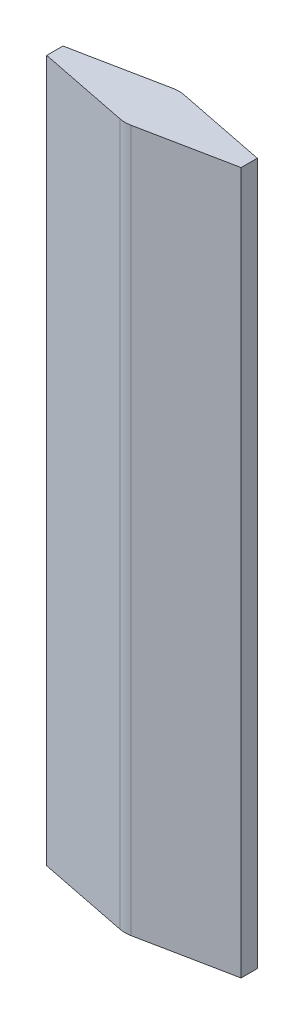
ISO-10303-21;
HEADER;
FILE_DESCRIPTION(('STEP AP214'),'2;1');
FILE_NAME('part.step','',(''),(''),'','','');
FILE_SCHEMA(('AUTOMOTIVE_DESIGN { 1 0 10303 214 1 1 1 1 }'));
ENDSEC;
DATA;
#1=APPLICATION_CONTEXT('core data for automotive mechanical design processes');
#2=APPLICATION_PROTOCOL_DEFINITION('international standard','automotive_design',2000,#1);
#3=PRODUCT_CONTEXT('',#1,'mechanical');
#4=PRODUCT('Part','Part','',(#3));
#5=PRODUCT_RELATED_PRODUCT_CATEGORY('part','',(#4));
#6=PRODUCT_DEFINITION_FORMATION('','',#4);
#7=PRODUCT_DEFINITION_CONTEXT('part definition',#1,'design');
#8=PRODUCT_DEFINITION('design','',#6,#7);
#9=PRODUCT_DEFINITION_SHAPE('','',#8);
#10=(LENGTH_UNIT() NAMED_UNIT(*) SI_UNIT(.MILLI.,.METRE.));
#11=(NAMED_UNIT(*) PLANE_ANGLE_UNIT() SI_UNIT($,.RADIAN.));
#12=(NAMED_UNIT(*) SI_UNIT($,.STERADIAN.) SOLID_ANGLE_UNIT());
#13=UNCERTAINTY_MEASURE_WITH_UNIT(LENGTH_MEASURE(1.E-05),#10,'distance_accuracy_value','');
#14=(GEOMETRIC_REPRESENTATION_CONTEXT(3) GLOBAL_UNCERTAINTY_ASSIGNED_CONTEXT((#13)) GLOBAL_UNIT_ASSIGNED_CONTEXT((#10,
#11,#12)) REPRESENTATION_CONTEXT('',''));
#15=CARTESIAN_POINT('',(0.,0.,0.));
#16=DIRECTION('',(0.,0.,1.));
#17=DIRECTION('',(1.,0.,0.));
#18=AXIS2_PLACEMENT_3D('',#15,#16,#17);
#19=CARTESIAN_POINT('',(-180.,650.,15.0111579880046));
#20=DIRECTION('',(0.196,0.,-0.9806038955664));
#21=DIRECTION('',(-0.9806038955664,0.,-0.196));
#22=AXIS2_PLACEMENT_3D('',#19,#20,#21);
#23=PLANE('',#22);
#24=DIRECTION('',(0.9806038955664,0.,0.196));
#25=VECTOR('',#24,1.);
#26=CARTESIAN_POINT('',(-180.,-650.,15.0111579880046));
#27=LINE('',#26,#25);
#28=CARTESIAN_POINT('',(-180.,-650.,15.0111579880046));
#29=VERTEX_POINT('',#28);
#30=CARTESIAN_POINT('',(-9.79999999999995,-650.,49.03019477832));
#31=VERTEX_POINT('',#30);
#32=EDGE_CURVE('E144',#29,#31,#27,.T.);
#33=ORIENTED_EDGE('',*,*,#32,.T.);
#34=DIRECTION('',(0.,-1.,0.));
#35=VECTOR('',#34,1.);
#36=CARTESIAN_POINT('',(-9.79999999999995,650.,49.03019477832));
#37=LINE('',#36,#35);
#38=CARTESIAN_POINT('',(-9.79999999999995,650.,49.03019477832));
#39=VERTEX_POINT('',#38);
#40=EDGE_CURVE('E48',#39,#31,#37,.T.);
#41=ORIENTED_EDGE('',*,*,#40,.F.);
#42=DIRECTION('',(0.9806038955664,0.,0.196));
#43=VECTOR('',#42,1.);
#44=CARTESIAN_POINT('',(-180.,650.,15.0111579880046));
#45=LINE('',#44,#43);
#46=CARTESIAN_POINT('',(-180.,650.,15.0111579880046));
#47=VERTEX_POINT('',#46);
#48=EDGE_CURVE('E100',#47,#39,#45,.T.);
#49=ORIENTED_EDGE('',*,*,#48,.F.);
#50=DIRECTION('',(0.,-1.,0.));
#51=VECTOR('',#50,1.);
#52=CARTESIAN_POINT('',(-180.,650.,15.0111579880046));
#53=LINE('',#52,#51);
#54=EDGE_CURVE('E11',#47,#29,#53,.T.);
#55=ORIENTED_EDGE('',*,*,#54,.T.);
#56=EDGE_LOOP('',(#33,#41,#49,#55));
#57=FACE_BOUND('',#56,.T.);
#58=ADVANCED_FACE('F39',(#57),#23,.F.);
#59=CARTESIAN_POINT('',(0.,650.,0.));
#60=DIRECTION('',(0.,-1.,0.));
#61=DIRECTION('',(0.,0.,-1.));
#62=AXIS2_PLACEMENT_3D('',#59,#60,#61);
#63=CYLINDRICAL_SURFACE('',#62,50.);
#64=CARTESIAN_POINT('',(0.,-650.,0.));
#65=DIRECTION('',(0.,1.,0.));
#66=DIRECTION('',(0.,0.,1.));
#67=AXIS2_PLACEMENT_3D('',#64,#65,#66);
#68=CIRCLE('',#67,50.);
#69=CARTESIAN_POINT('',(9.79999999999999,-650.,49.03019477832));
#70=VERTEX_POINT('',#69);
#71=EDGE_CURVE('E147',#31,#70,#68,.T.);
#72=ORIENTED_EDGE('',*,*,#71,.T.);
#73=DIRECTION('',(0.,-1.,0.));
#74=VECTOR('',#73,1.);
#75=CARTESIAN_POINT('',(9.79999999999999,650.,49.03019477832));
#76=LINE('',#75,#74);
#77=CARTESIAN_POINT('',(9.79999999999999,650.,49.03019477832));
#78=VERTEX_POINT('',#77);
#79=EDGE_CURVE('E176',#78,#70,#76,.T.);
#80=ORIENTED_EDGE('',*,*,#79,.F.);
#81=CARTESIAN_POINT('',(0.,650.,0.));
#82=DIRECTION('',(0.,1.,0.));
#83=DIRECTION('',(0.,0.,1.));
#84=AXIS2_PLACEMENT_3D('',#81,#82,#83);
#85=CIRCLE('',#84,50.);
#86=EDGE_CURVE('E186',#39,#78,#85,.T.);
#87=ORIENTED_EDGE('',*,*,#86,.F.);
#88=ORIENTED_EDGE('',*,*,#40,.T.);
#89=EDGE_LOOP('',(#72,#80,#87,#88));
#90=FACE_BOUND('',#89,.T.);
#91=ADVANCED_FACE('F184',(#90),#63,.T.);
#92=CARTESIAN_POINT('',(9.79999999999999,650.,49.03019477832));
#93=DIRECTION('',(-0.196,0.,-0.9806038955664));
#94=DIRECTION('',(-0.980603895566401,0.,0.196));
#95=AXIS2_PLACEMENT_3D('',#92,#93,#94);
#96=PLANE('',#95);
#97=DIRECTION('',(0.9806038955664,0.,-0.196));
#98=VECTOR('',#97,1.);
#99=CARTESIAN_POINT('',(9.79999999999999,-650.,49.03019477832));
#100=LINE('',#99,#98);
#101=CARTESIAN_POINT('',(180.,-650.,15.0111579880046));
#102=VERTEX_POINT('',#101);
#103=EDGE_CURVE('E150',#70,#102,#100,.T.);
#104=ORIENTED_EDGE('',*,*,#103,.T.);
#105=DIRECTION('',(0.,-1.,0.));
#106=VECTOR('',#105,1.);
#107=CARTESIAN_POINT('',(180.,650.,15.0111579880046));
#108=LINE('',#107,#106);
#109=CARTESIAN_POINT('',(180.,650.,15.0111579880046));
#110=VERTEX_POINT('',#109);
#111=EDGE_CURVE('E172',#110,#102,#108,.T.);
#112=ORIENTED_EDGE('',*,*,#111,.F.);
#113=DIRECTION('',(0.9806038955664,0.,-0.196));
#114=VECTOR('',#113,1.);
#115=CARTESIAN_POINT('',(9.79999999999999,650.,49.03019477832));
#116=LINE('',#115,#114);
#117=EDGE_CURVE('E199',#78,#110,#116,.T.);
#118=ORIENTED_EDGE('',*,*,#117,.F.);
#119=ORIENTED_EDGE('',*,*,#79,.T.);
#120=EDGE_LOOP('',(#104,#112,#118,#119));
#121=FACE_BOUND('',#120,.T.);
#122=ADVANCED_FACE('F194',(#121),#96,.F.);
#123=CARTESIAN_POINT('',(180.,650.,0.));
#124=DIRECTION('',(-1.,0.,0.));
#125=DIRECTION('',(0.,0.,1.));
#126=AXIS2_PLACEMENT_3D('',#123,#124,#125);
#127=PLANE('',#126);
#128=DIRECTION('',(0.,0.,-1.));
#129=VECTOR('',#128,1.);
#130=CARTESIAN_POINT('',(180.,-650.,0.));
#131=LINE('',#130,#129);
#132=CARTESIAN_POINT('',(180.,-650.,-15.0111579880046));
#133=VERTEX_POINT('',#132);
#134=EDGE_CURVE('E154',#102,#133,#131,.T.);
#135=ORIENTED_EDGE('',*,*,#134,.T.);
#136=DIRECTION('',(0.,-1.,0.));
#137=VECTOR('',#136,1.);
#138=CARTESIAN_POINT('',(180.,650.,-15.0111579880046));
#139=LINE('',#138,#137);
#140=CARTESIAN_POINT('',(180.,650.,-15.0111579880046));
#141=VERTEX_POINT('',#140);
#142=EDGE_CURVE('E131',#141,#133,#139,.T.);
#143=ORIENTED_EDGE('',*,*,#142,.F.);
#144=DIRECTION('',(0.,0.,-1.));
#145=VECTOR('',#144,1.);
#146=CARTESIAN_POINT('',(180.,650.,0.));
#147=LINE('',#146,#145);
#148=EDGE_CURVE('E120',#110,#141,#147,.T.);
#149=ORIENTED_EDGE('',*,*,#148,.F.);
#150=ORIENTED_EDGE('',*,*,#111,.T.);
#151=EDGE_LOOP('',(#135,#143,#149,#150));
#152=FACE_BOUND('',#151,.T.);
#153=ADVANCED_FACE('F197',(#152),#127,.F.);
#154=CARTESIAN_POINT('',(180.,650.,-15.0111579880046));
#155=DIRECTION('',(-0.196,0.,0.9806038955664));
#156=DIRECTION('',(0.980603895566401,0.,0.196));
#157=AXIS2_PLACEMENT_3D('',#154,#155,#156);
#158=PLANE('',#157);
#159=DIRECTION('',(-0.9806038955664,0.,-0.196));
#160=VECTOR('',#159,1.);
#161=CARTESIAN_POINT('',(180.,-650.,-15.0111579880046));
#162=LINE('',#161,#160);
#163=CARTESIAN_POINT('',(9.80000000000001,-650.,-49.03019477832));
#164=VERTEX_POINT('',#163);
#165=EDGE_CURVE('E129',#133,#164,#162,.T.);
#166=ORIENTED_EDGE('',*,*,#165,.T.);
#167=DIRECTION('',(0.,-1.,0.));
#168=VECTOR('',#167,1.);
#169=CARTESIAN_POINT('',(9.80000000000001,650.,-49.03019477832));
#170=LINE('',#169,#168);
#171=CARTESIAN_POINT('',(9.80000000000001,650.,-49.03019477832));
#172=VERTEX_POINT('',#171);
#173=EDGE_CURVE('E126',#172,#164,#170,.T.);
#174=ORIENTED_EDGE('',*,*,#173,.F.);
#175=DIRECTION('',(-0.9806038955664,0.,-0.196));
#176=VECTOR('',#175,1.);
#177=CARTESIAN_POINT('',(180.,650.,-15.0111579880046));
#178=LINE('',#177,#176);
#179=EDGE_CURVE('E114',#141,#172,#178,.T.);
#180=ORIENTED_EDGE('',*,*,#179,.F.);
#181=ORIENTED_EDGE('',*,*,#142,.T.);
#182=EDGE_LOOP('',(#166,#174,#180,#181));
#183=FACE_BOUND('',#182,.T.);
#184=ADVANCED_FACE('F127',(#183),#158,.F.);
#185=CARTESIAN_POINT('',(0.,650.,0.));
#186=DIRECTION('',(0.,-1.,0.));
#187=DIRECTION('',(0.,0.,-1.));
#188=AXIS2_PLACEMENT_3D('',#185,#186,#187);
#189=CYLINDRICAL_SURFACE('',#188,50.);
#190=CARTESIAN_POINT('',(0.,-650.,0.));
#191=DIRECTION('',(0.,1.,0.));
#192=DIRECTION('',(0.,0.,1.));
#193=AXIS2_PLACEMENT_3D('',#190,#191,#192);
#194=CIRCLE('',#193,50.);
#195=CARTESIAN_POINT('',(-9.79999996729933,-650.,-49.0301947848561));
#196=VERTEX_POINT('',#195);
#197=EDGE_CURVE('E86',#164,#196,#194,.T.);
#198=ORIENTED_EDGE('',*,*,#197,.T.);
#199=DIRECTION('',(0.,-1.,0.));
#200=VECTOR('',#199,1.);
#201=CARTESIAN_POINT('',(-9.79999996729933,650.,-49.0301947848561));
#202=LINE('',#201,#200);
#203=CARTESIAN_POINT('',(-9.79999996729933,650.,-49.0301947848561));
#204=VERTEX_POINT('',#203);
#205=EDGE_CURVE('E132',#204,#196,#202,.T.);
#206=ORIENTED_EDGE('',*,*,#205,.F.);
#207=CARTESIAN_POINT('',(0.,650.,0.));
#208=DIRECTION('',(0.,1.,0.));
#209=DIRECTION('',(0.,0.,1.));
#210=AXIS2_PLACEMENT_3D('',#207,#208,#209);
#211=CIRCLE('',#210,50.);
#212=EDGE_CURVE('E118',#172,#204,#211,.T.);
#213=ORIENTED_EDGE('',*,*,#212,.F.);
#214=ORIENTED_EDGE('',*,*,#173,.T.);
#215=EDGE_LOOP('',(#198,#206,#213,#214));
#216=FACE_BOUND('',#215,.T.);
#217=ADVANCED_FACE('F134',(#216),#189,.T.);
#218=CARTESIAN_POINT('',(-9.79999996729933,650.,-49.0301947848561));
#219=DIRECTION('',(0.196,0.,0.9806038955664));
#220=DIRECTION('',(0.9806038955664,0.,-0.196));
#221=AXIS2_PLACEMENT_3D('',#218,#219,#220);
#222=PLANE('',#221);
#223=DIRECTION('',(-0.9806038955664,0.,0.196));
#224=VECTOR('',#223,1.);
#225=CARTESIAN_POINT('',(-9.79999996729933,-650.,-49.0301947848561));
#226=LINE('',#225,#224);
#227=CARTESIAN_POINT('',(-180.,-650.,-15.0111579880046));
#228=VERTEX_POINT('',#227);
#229=EDGE_CURVE('E93',#196,#228,#226,.T.);
#230=ORIENTED_EDGE('',*,*,#229,.T.);
#231=DIRECTION('',(0.,-1.,0.));
#232=VECTOR('',#231,1.);
#233=CARTESIAN_POINT('',(-180.,650.,-15.0111579880046));
#234=LINE('',#233,#232);
#235=CARTESIAN_POINT('',(-180.,650.,-15.0111579880046));
#236=VERTEX_POINT('',#235);
#237=EDGE_CURVE('E140',#236,#228,#234,.T.);
#238=ORIENTED_EDGE('',*,*,#237,.F.);
#239=DIRECTION('',(-0.9806038955664,0.,0.196));
#240=VECTOR('',#239,1.);
#241=CARTESIAN_POINT('',(-9.79999996729933,650.,-49.0301947848561));
#242=LINE('',#241,#240);
#243=EDGE_CURVE('E137',#204,#236,#242,.T.);
#244=ORIENTED_EDGE('',*,*,#243,.F.);
#245=ORIENTED_EDGE('',*,*,#205,.T.);
#246=EDGE_LOOP('',(#230,#238,#244,#245));
#247=FACE_BOUND('',#246,.T.);
#248=ADVANCED_FACE('F224',(#247),#222,.F.);
#249=CARTESIAN_POINT('',(-180.,650.,0.));
#250=DIRECTION('',(1.,0.,0.));
#251=DIRECTION('',(0.,0.,-1.));
#252=AXIS2_PLACEMENT_3D('',#249,#250,#251);
#253=PLANE('',#252);
#254=DIRECTION('',(0.,0.,1.));
#255=VECTOR('',#254,1.);
#256=CARTESIAN_POINT('',(-180.,-650.,0.));
#257=LINE('',#256,#255);
#258=EDGE_CURVE('E163',#228,#29,#257,.T.);
#259=ORIENTED_EDGE('',*,*,#258,.T.);
#260=ORIENTED_EDGE('',*,*,#54,.F.);
#261=DIRECTION('',(0.,0.,1.));
#262=VECTOR('',#261,1.);
#263=CARTESIAN_POINT('',(-180.,650.,0.));
#264=LINE('',#263,#262);
#265=EDGE_CURVE('E56',#236,#47,#264,.T.);
#266=ORIENTED_EDGE('',*,*,#265,.F.);
#267=ORIENTED_EDGE('',*,*,#237,.T.);
#268=EDGE_LOOP('',(#259,#260,#266,#267));
#269=FACE_BOUND('',#268,.T.);
#270=ADVANCED_FACE('F208',(#269),#253,.F.);
#271=CARTESIAN_POINT('',(0.,650.,0.));
#272=DIRECTION('',(0.,1.,0.));
#273=DIRECTION('',(0.,0.,1.));
#274=AXIS2_PLACEMENT_3D('',#271,#272,#273);
#275=PLANE('',#274);
#276=ORIENTED_EDGE('',*,*,#265,.T.);
#277=ORIENTED_EDGE('',*,*,#48,.T.);
#278=ORIENTED_EDGE('',*,*,#86,.T.);
#279=ORIENTED_EDGE('',*,*,#117,.T.);
#280=ORIENTED_EDGE('',*,*,#148,.T.);
#281=ORIENTED_EDGE('',*,*,#179,.T.);
#282=ORIENTED_EDGE('',*,*,#212,.T.);
#283=ORIENTED_EDGE('',*,*,#243,.T.);
#284=EDGE_LOOP('',(#276,#277,#278,#279,#280,#281,#282,#283));
#285=FACE_BOUND('',#284,.T.);
#286=ADVANCED_FACE('F116',(#285),#275,.T.);
#287=CARTESIAN_POINT('',(0.,-650.,0.));
#288=DIRECTION('',(0.,1.,0.));
#289=DIRECTION('',(0.,0.,1.));
#290=AXIS2_PLACEMENT_3D('',#287,#288,#289);
#291=PLANE('',#290);
#292=ORIENTED_EDGE('',*,*,#32,.F.);
#293=ORIENTED_EDGE('',*,*,#258,.F.);
#294=ORIENTED_EDGE('',*,*,#229,.F.);
#295=ORIENTED_EDGE('',*,*,#197,.F.);
#296=ORIENTED_EDGE('',*,*,#165,.F.);
#297=ORIENTED_EDGE('',*,*,#134,.F.);
#298=ORIENTED_EDGE('',*,*,#103,.F.);
#299=ORIENTED_EDGE('',*,*,#71,.F.);
#300=EDGE_LOOP('',(#292,#293,#294,#295,#296,#297,#298,#299));
#301=FACE_BOUND('',#300,.T.);
#302=ADVANCED_FACE('F190',(#301),#291,.F.);
#303=CLOSED_SHELL('',(#58,#91,#122,#153,#184,#217,#248,#270,#286,#302));
#304=MANIFOLD_SOLID_BREP('B2',#303);
#305=ADVANCED_BREP_SHAPE_REPRESENTATION('',(#18,#304),#14);
#306=SHAPE_DEFINITION_REPRESENTATION(#9,#305);
ENDSEC;
END-ISO-10303-21;
